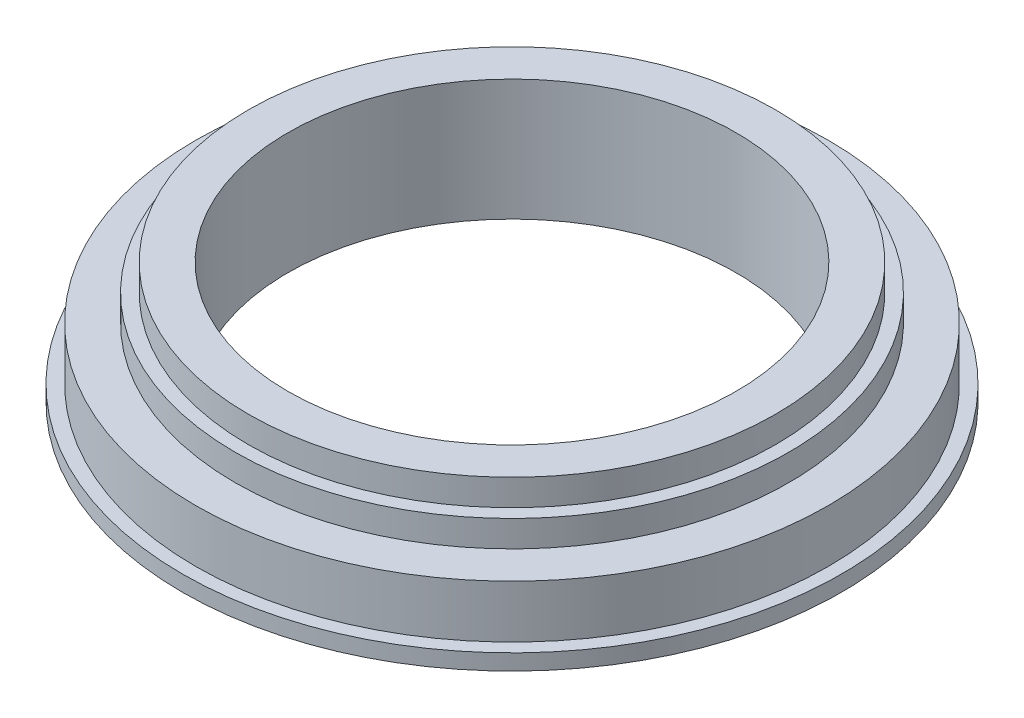
ISO-10303-21;
HEADER;
FILE_DESCRIPTION(('STEP AP214'),'2;1');
FILE_NAME('part.step','',(''),(''),'','','');
FILE_SCHEMA(('AUTOMOTIVE_DESIGN { 1 0 10303 214 1 1 1 1 }'));
ENDSEC;
DATA;
#1=APPLICATION_CONTEXT('core data for automotive mechanical design processes');
#2=APPLICATION_PROTOCOL_DEFINITION('international standard','automotive_design',2000,#1);
#3=PRODUCT_CONTEXT('',#1,'mechanical');
#4=PRODUCT('Part','Part','',(#3));
#5=PRODUCT_RELATED_PRODUCT_CATEGORY('part','',(#4));
#6=PRODUCT_DEFINITION_FORMATION('','',#4);
#7=PRODUCT_DEFINITION_CONTEXT('part definition',#1,'design');
#8=PRODUCT_DEFINITION('design','',#6,#7);
#9=PRODUCT_DEFINITION_SHAPE('','',#8);
#10=(LENGTH_UNIT() NAMED_UNIT(*) SI_UNIT(.MILLI.,.METRE.));
#11=(NAMED_UNIT(*) PLANE_ANGLE_UNIT() SI_UNIT($,.RADIAN.));
#12=(NAMED_UNIT(*) SI_UNIT($,.STERADIAN.) SOLID_ANGLE_UNIT());
#13=UNCERTAINTY_MEASURE_WITH_UNIT(LENGTH_MEASURE(1.E-05),#10,'distance_accuracy_value','');
#14=(GEOMETRIC_REPRESENTATION_CONTEXT(3) GLOBAL_UNCERTAINTY_ASSIGNED_CONTEXT((#13)) GLOBAL_UNIT_ASSIGNED_CONTEXT((#10,
#11,#12)) REPRESENTATION_CONTEXT('',''));
#15=CARTESIAN_POINT('',(0.,0.,0.));
#16=DIRECTION('',(0.,0.,1.));
#17=DIRECTION('',(1.,0.,0.));
#18=AXIS2_PLACEMENT_3D('',#15,#16,#17);
#19=CARTESIAN_POINT('',(0.,3.,0.));
#20=DIRECTION('',(0.,-1.,0.));
#21=DIRECTION('',(0.,0.,-1.));
#22=AXIS2_PLACEMENT_3D('',#19,#20,#21);
#23=CYLINDRICAL_SURFACE('',#22,62.5);
#24=CARTESIAN_POINT('',(0.,3.,0.));
#25=DIRECTION('',(0.,1.,0.));
#26=DIRECTION('',(0.,0.,1.));
#27=AXIS2_PLACEMENT_3D('',#24,#25,#26);
#28=CIRCLE('',#27,62.5);
#29=CARTESIAN_POINT('',(0.,3.,62.5));
#30=VERTEX_POINT('',#29);
#31=EDGE_CURVE('E10',#30,#30,#28,.T.);
#32=ORIENTED_EDGE('',*,*,#31,.F.);
#33=EDGE_LOOP('',(#32));
#34=FACE_BOUND('',#33,.T.);
#35=CARTESIAN_POINT('',(0.,0.,0.));
#36=DIRECTION('',(0.,1.,0.));
#37=DIRECTION('',(0.,0.,1.));
#38=AXIS2_PLACEMENT_3D('',#35,#36,#37);
#39=CIRCLE('',#38,62.5);
#40=CARTESIAN_POINT('',(0.,0.,62.5));
#41=VERTEX_POINT('',#40);
#42=EDGE_CURVE('E40',#41,#41,#39,.T.);
#43=ORIENTED_EDGE('',*,*,#42,.T.);
#44=EDGE_LOOP('',(#43));
#45=FACE_BOUND('',#44,.T.);
#46=ADVANCED_FACE('F37',(#34,#45),#23,.T.);
#47=CARTESIAN_POINT('',(0.,3.,0.));
#48=DIRECTION('',(0.,1.,0.));
#49=DIRECTION('',(0.,0.,1.));
#50=AXIS2_PLACEMENT_3D('',#47,#48,#49);
#51=PLANE('',#50);
#52=CARTESIAN_POINT('',(0.,3.,0.));
#53=DIRECTION('',(0.,1.,0.));
#54=DIRECTION('',(0.,0.,1.));
#55=AXIS2_PLACEMENT_3D('',#52,#53,#54);
#56=CIRCLE('',#55,60.);
#57=CARTESIAN_POINT('',(0.,3.,60.));
#58=VERTEX_POINT('',#57);
#59=EDGE_CURVE('E51',#58,#58,#56,.T.);
#60=ORIENTED_EDGE('',*,*,#59,.F.);
#61=EDGE_LOOP('',(#60));
#62=FACE_BOUND('',#61,.T.);
#63=ORIENTED_EDGE('',*,*,#31,.T.);
#64=EDGE_LOOP('',(#63));
#65=FACE_BOUND('',#64,.T.);
#66=ADVANCED_FACE('F99',(#62,#65),#51,.T.);
#67=CARTESIAN_POINT('',(0.,0.,0.));
#68=DIRECTION('',(0.,1.,0.));
#69=DIRECTION('',(0.,0.,1.));
#70=AXIS2_PLACEMENT_3D('',#67,#68,#69);
#71=PLANE('',#70);
#72=CARTESIAN_POINT('',(0.,0.,0.));
#73=DIRECTION('',(0.,1.,0.));
#74=DIRECTION('',(0.,0.,1.));
#75=AXIS2_PLACEMENT_3D('',#72,#73,#74);
#76=CIRCLE('',#75,42.5);
#77=CARTESIAN_POINT('',(0.,0.,42.5));
#78=VERTEX_POINT('',#77);
#79=EDGE_CURVE('E78',#78,#78,#76,.T.);
#80=ORIENTED_EDGE('',*,*,#79,.T.);
#81=EDGE_LOOP('',(#80));
#82=FACE_BOUND('',#81,.T.);
#83=ORIENTED_EDGE('',*,*,#42,.F.);
#84=EDGE_LOOP('',(#83));
#85=FACE_BOUND('',#84,.T.);
#86=ADVANCED_FACE('F83',(#82,#85),#71,.F.);
#87=CARTESIAN_POINT('',(0.,13.,0.));
#88=DIRECTION('',(0.,1.,0.));
#89=DIRECTION('',(0.,0.,1.));
#90=AXIS2_PLACEMENT_3D('',#87,#88,#89);
#91=PLANE('',#90);
#92=CARTESIAN_POINT('',(0.,13.,0.));
#93=DIRECTION('',(0.,1.,0.));
#94=DIRECTION('',(0.,0.,1.));
#95=AXIS2_PLACEMENT_3D('',#92,#93,#94);
#96=CIRCLE('',#95,60.);
#97=CARTESIAN_POINT('',(0.,13.,60.));
#98=VERTEX_POINT('',#97);
#99=EDGE_CURVE('E49',#98,#98,#96,.T.);
#100=ORIENTED_EDGE('',*,*,#99,.T.);
#101=EDGE_LOOP('',(#100));
#102=FACE_BOUND('',#101,.T.);
#103=CARTESIAN_POINT('',(0.,13.,0.));
#104=DIRECTION('',(0.,1.,0.));
#105=DIRECTION('',(0.,0.,1.));
#106=AXIS2_PLACEMENT_3D('',#103,#104,#105);
#107=CIRCLE('',#106,52.5);
#108=CARTESIAN_POINT('',(0.,13.,52.5));
#109=VERTEX_POINT('',#108);
#110=EDGE_CURVE('E55',#109,#109,#107,.T.);
#111=ORIENTED_EDGE('',*,*,#110,.F.);
#112=EDGE_LOOP('',(#111));
#113=FACE_BOUND('',#112,.T.);
#114=ADVANCED_FACE('F109',(#102,#113),#91,.T.);
#115=CARTESIAN_POINT('',(0.,13.,0.));
#116=DIRECTION('',(0.,-1.,0.));
#117=DIRECTION('',(0.,0.,-1.));
#118=AXIS2_PLACEMENT_3D('',#115,#116,#117);
#119=CYLINDRICAL_SURFACE('',#118,60.);
#120=ORIENTED_EDGE('',*,*,#99,.F.);
#121=EDGE_LOOP('',(#120));
#122=FACE_BOUND('',#121,.T.);
#123=ORIENTED_EDGE('',*,*,#59,.T.);
#124=EDGE_LOOP('',(#123));
#125=FACE_BOUND('',#124,.T.);
#126=ADVANCED_FACE('F113',(#122,#125),#119,.T.);
#127=CARTESIAN_POINT('',(0.,18.,0.));
#128=DIRECTION('',(0.,1.,0.));
#129=DIRECTION('',(0.,0.,1.));
#130=AXIS2_PLACEMENT_3D('',#127,#128,#129);
#131=PLANE('',#130);
#132=CARTESIAN_POINT('',(0.,18.,0.));
#133=DIRECTION('',(0.,1.,0.));
#134=DIRECTION('',(0.,0.,1.));
#135=AXIS2_PLACEMENT_3D('',#132,#133,#134);
#136=CIRCLE('',#135,52.5);
#137=CARTESIAN_POINT('',(0.,18.,52.5));
#138=VERTEX_POINT('',#137);
#139=EDGE_CURVE('E62',#138,#138,#136,.T.);
#140=ORIENTED_EDGE('',*,*,#139,.T.);
#141=EDGE_LOOP('',(#140));
#142=FACE_BOUND('',#141,.T.);
#143=CARTESIAN_POINT('',(0.,18.,0.));
#144=DIRECTION('',(0.,1.,0.));
#145=DIRECTION('',(0.,0.,1.));
#146=AXIS2_PLACEMENT_3D('',#143,#144,#145);
#147=CIRCLE('',#146,50.);
#148=CARTESIAN_POINT('',(0.,18.,50.));
#149=VERTEX_POINT('',#148);
#150=EDGE_CURVE('E66',#149,#149,#147,.T.);
#151=ORIENTED_EDGE('',*,*,#150,.F.);
#152=EDGE_LOOP('',(#151));
#153=FACE_BOUND('',#152,.T.);
#154=ADVANCED_FACE('F118',(#142,#153),#131,.T.);
#155=CARTESIAN_POINT('',(0.,18.,0.));
#156=DIRECTION('',(0.,-1.,0.));
#157=DIRECTION('',(0.,0.,-1.));
#158=AXIS2_PLACEMENT_3D('',#155,#156,#157);
#159=CYLINDRICAL_SURFACE('',#158,52.5);
#160=ORIENTED_EDGE('',*,*,#110,.T.);
#161=EDGE_LOOP('',(#160));
#162=FACE_BOUND('',#161,.T.);
#163=ORIENTED_EDGE('',*,*,#139,.F.);
#164=EDGE_LOOP('',(#163));
#165=FACE_BOUND('',#164,.T.);
#166=ADVANCED_FACE('F121',(#162,#165),#159,.T.);
#167=CARTESIAN_POINT('',(0.,23.,0.));
#168=DIRECTION('',(0.,1.,0.));
#169=DIRECTION('',(0.,0.,1.));
#170=AXIS2_PLACEMENT_3D('',#167,#168,#169);
#171=PLANE('',#170);
#172=CARTESIAN_POINT('',(0.,23.,0.));
#173=DIRECTION('',(0.,1.,0.));
#174=DIRECTION('',(0.,0.,1.));
#175=AXIS2_PLACEMENT_3D('',#172,#173,#174);
#176=CIRCLE('',#175,50.);
#177=CARTESIAN_POINT('',(0.,23.,50.));
#178=VERTEX_POINT('',#177);
#179=EDGE_CURVE('E70',#178,#178,#176,.T.);
#180=ORIENTED_EDGE('',*,*,#179,.T.);
#181=EDGE_LOOP('',(#180));
#182=FACE_BOUND('',#181,.T.);
#183=CARTESIAN_POINT('',(0.,23.,0.));
#184=DIRECTION('',(0.,1.,0.));
#185=DIRECTION('',(0.,0.,1.));
#186=AXIS2_PLACEMENT_3D('',#183,#184,#185);
#187=CIRCLE('',#186,42.5);
#188=CARTESIAN_POINT('',(0.,23.,42.5));
#189=VERTEX_POINT('',#188);
#190=EDGE_CURVE('E74',#189,#189,#187,.T.);
#191=ORIENTED_EDGE('',*,*,#190,.F.);
#192=EDGE_LOOP('',(#191));
#193=FACE_BOUND('',#192,.T.);
#194=ADVANCED_FACE('F94',(#182,#193),#171,.T.);
#195=CARTESIAN_POINT('',(0.,23.,0.));
#196=DIRECTION('',(0.,-1.,0.));
#197=DIRECTION('',(0.,0.,-1.));
#198=AXIS2_PLACEMENT_3D('',#195,#196,#197);
#199=CYLINDRICAL_SURFACE('',#198,50.);
#200=ORIENTED_EDGE('',*,*,#150,.T.);
#201=EDGE_LOOP('',(#200));
#202=FACE_BOUND('',#201,.T.);
#203=ORIENTED_EDGE('',*,*,#179,.F.);
#204=EDGE_LOOP('',(#203));
#205=FACE_BOUND('',#204,.T.);
#206=ADVANCED_FACE('F88',(#202,#205),#199,.T.);
#207=CARTESIAN_POINT('',(0.,23.,0.));
#208=DIRECTION('',(0.,-1.,0.));
#209=DIRECTION('',(0.,0.,-1.));
#210=AXIS2_PLACEMENT_3D('',#207,#208,#209);
#211=CYLINDRICAL_SURFACE('',#210,42.5);
#212=ORIENTED_EDGE('',*,*,#190,.T.);
#213=EDGE_LOOP('',(#212));
#214=FACE_BOUND('',#213,.T.);
#215=ORIENTED_EDGE('',*,*,#79,.F.);
#216=EDGE_LOOP('',(#215));
#217=FACE_BOUND('',#216,.T.);
#218=ADVANCED_FACE('F86',(#214,#217),#211,.F.);
#219=CLOSED_SHELL('',(#46,#66,#86,#114,#126,#154,#166,#194,#206,#218));
#220=MANIFOLD_SOLID_BREP('B2',#219);
#221=ADVANCED_BREP_SHAPE_REPRESENTATION('',(#18,#220),#14);
#222=SHAPE_DEFINITION_REPRESENTATION(#9,#221);
ENDSEC;
END-ISO-10303-21;
